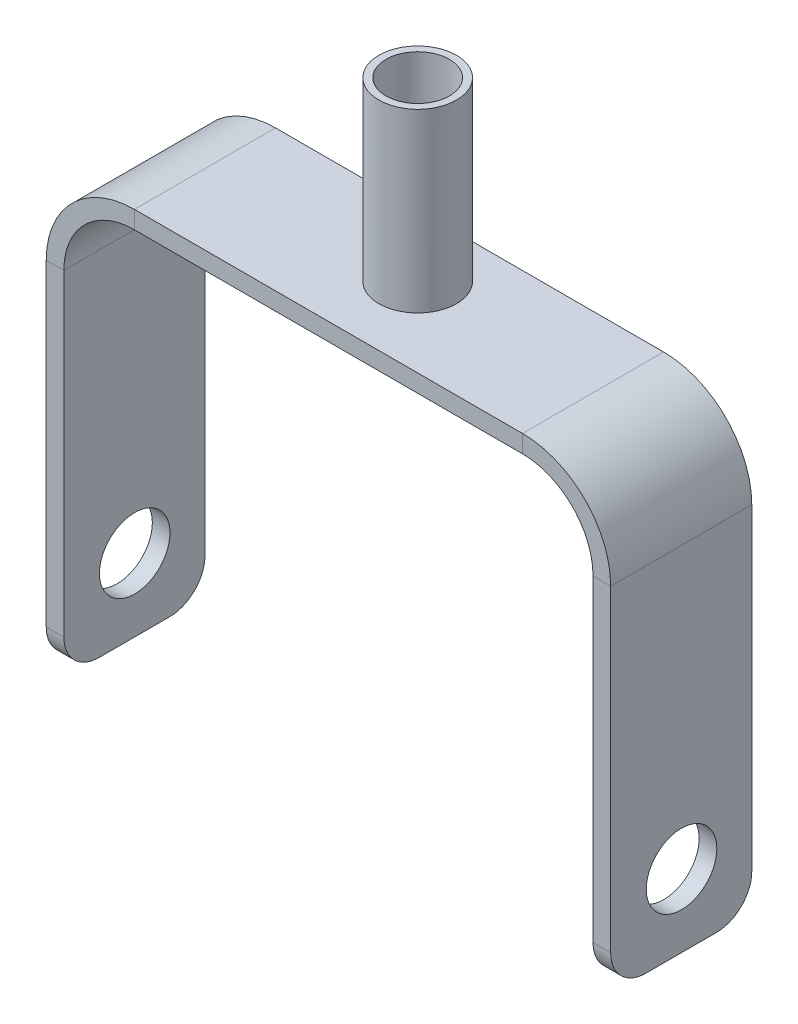
ISO-10303-21;
HEADER;
FILE_DESCRIPTION(('STEP AP214'),'2;1');
FILE_NAME('part.step','',(''),(''),'','','');
FILE_SCHEMA(('AUTOMOTIVE_DESIGN { 1 0 10303 214 1 1 1 1 }'));
ENDSEC;
DATA;
#1=APPLICATION_CONTEXT('core data for automotive mechanical design processes');
#2=APPLICATION_PROTOCOL_DEFINITION('international standard','automotive_design',2000,#1);
#3=PRODUCT_CONTEXT('',#1,'mechanical');
#4=PRODUCT('Part','Part','',(#3));
#5=PRODUCT_RELATED_PRODUCT_CATEGORY('part','',(#4));
#6=PRODUCT_DEFINITION_FORMATION('','',#4);
#7=PRODUCT_DEFINITION_CONTEXT('part definition',#1,'design');
#8=PRODUCT_DEFINITION('design','',#6,#7);
#9=PRODUCT_DEFINITION_SHAPE('','',#8);
#10=(LENGTH_UNIT() NAMED_UNIT(*) SI_UNIT(.MILLI.,.METRE.));
#11=(NAMED_UNIT(*) PLANE_ANGLE_UNIT() SI_UNIT($,.RADIAN.));
#12=(NAMED_UNIT(*) SI_UNIT($,.STERADIAN.) SOLID_ANGLE_UNIT());
#13=UNCERTAINTY_MEASURE_WITH_UNIT(LENGTH_MEASURE(1.E-05),#10,'distance_accuracy_value','');
#14=(GEOMETRIC_REPRESENTATION_CONTEXT(3) GLOBAL_UNCERTAINTY_ASSIGNED_CONTEXT((#13)) GLOBAL_UNIT_ASSIGNED_CONTEXT((#10,
#11,#12)) REPRESENTATION_CONTEXT('',''));
#15=CARTESIAN_POINT('',(0.,0.,0.));
#16=DIRECTION('',(0.,0.,1.));
#17=DIRECTION('',(1.,0.,0.));
#18=AXIS2_PLACEMENT_3D('',#15,#16,#17);
#19=CARTESIAN_POINT('',(20.,125.,40.));
#20=DIRECTION('',(0.,-1.,0.));
#21=DIRECTION('',(0.,0.,-1.));
#22=AXIS2_PLACEMENT_3D('',#19,#20,#21);
#23=PLANE('',#22);
#24=DIRECTION('',(1.,0.,0.));
#25=VECTOR('',#24,1.);
#26=CARTESIAN_POINT('',(20.,125.,0.));
#27=LINE('',#26,#25);
#28=CARTESIAN_POINT('',(130.,125.,0.));
#29=VERTEX_POINT('',#28);
#30=CARTESIAN_POINT('',(20.,125.,0.));
#31=VERTEX_POINT('',#30);
#32=EDGE_CURVE('E228',#29,#31,#27,.F.);
#33=ORIENTED_EDGE('',*,*,#32,.T.);
#34=DIRECTION('',(0.,0.,-1.));
#35=VECTOR('',#34,1.);
#36=CARTESIAN_POINT('',(20.,125.,40.));
#37=LINE('',#36,#35);
#38=CARTESIAN_POINT('',(20.,125.,40.));
#39=VERTEX_POINT('',#38);
#40=EDGE_CURVE('E236',#39,#31,#37,.T.);
#41=ORIENTED_EDGE('',*,*,#40,.F.);
#42=DIRECTION('',(1.,0.,0.));
#43=VECTOR('',#42,1.);
#44=CARTESIAN_POINT('',(20.,125.,40.));
#45=LINE('',#44,#43);
#46=CARTESIAN_POINT('',(130.,125.,40.));
#47=VERTEX_POINT('',#46);
#48=EDGE_CURVE('E203',#47,#39,#45,.F.);
#49=ORIENTED_EDGE('',*,*,#48,.F.);
#50=DIRECTION('',(0.,0.,-1.));
#51=VECTOR('',#50,1.);
#52=CARTESIAN_POINT('',(130.,125.,40.));
#53=LINE('',#52,#51);
#54=EDGE_CURVE('E239',#47,#29,#53,.T.);
#55=ORIENTED_EDGE('',*,*,#54,.T.);
#56=EDGE_LOOP('',(#33,#41,#49,#55));
#57=FACE_BOUND('',#56,.T.);
#58=CARTESIAN_POINT('',(77.8034529187826,125.,17.5080418499708));
#59=DIRECTION('',(0.,-1.,0.));
#60=DIRECTION('',(0.,0.,-1.));
#61=AXIS2_PLACEMENT_3D('',#58,#59,#60);
#62=CIRCLE('',#61,11.);
#63=CARTESIAN_POINT('',(77.8034529187826,125.,6.50804184997082));
#64=VERTEX_POINT('',#63);
#65=EDGE_CURVE('E11',#64,#64,#62,.F.);
#66=ORIENTED_EDGE('',*,*,#65,.F.);
#67=EDGE_LOOP('',(#66));
#68=FACE_BOUND('',#67,.T.);
#69=ADVANCED_FACE('F34',(#57,#68),#23,.F.);
#70=CARTESIAN_POINT('',(0.,100.,40.));
#71=DIRECTION('',(0.,0.,1.));
#72=DIRECTION('',(1.,0.,0.));
#73=AXIS2_PLACEMENT_3D('',#70,#71,#72);
#74=PLANE('',#73);
#75=DIRECTION('',(-1.,0.,0.));
#76=VECTOR('',#75,1.);
#77=CARTESIAN_POINT('',(0.,100.,40.));
#78=LINE('',#77,#76);
#79=CARTESIAN_POINT('',(0.,100.,40.));
#80=VERTEX_POINT('',#79);
#81=CARTESIAN_POINT('',(-5.,100.,40.));
#82=VERTEX_POINT('',#81);
#83=EDGE_CURVE('E149',#80,#82,#78,.T.);
#84=ORIENTED_EDGE('',*,*,#83,.F.);
#85=CARTESIAN_POINT('',(20.,100.,40.));
#86=DIRECTION('',(0.,0.,1.));
#87=DIRECTION('',(-1.,0.,0.));
#88=AXIS2_PLACEMENT_3D('',#85,#86,#87);
#89=CIRCLE('',#88,20.);
#90=CARTESIAN_POINT('',(20.,120.,40.));
#91=VERTEX_POINT('',#90);
#92=EDGE_CURVE('E153',#91,#80,#89,.T.);
#93=ORIENTED_EDGE('',*,*,#92,.F.);
#94=DIRECTION('',(0.,-1.,0.));
#95=VECTOR('',#94,1.);
#96=CARTESIAN_POINT('',(20.,125.,40.));
#97=LINE('',#96,#95);
#98=EDGE_CURVE('E162',#39,#91,#97,.T.);
#99=ORIENTED_EDGE('',*,*,#98,.F.);
#100=CARTESIAN_POINT('',(20.,100.,40.));
#101=DIRECTION('',(0.,0.,1.));
#102=DIRECTION('',(1.,0.,0.));
#103=AXIS2_PLACEMENT_3D('',#100,#101,#102);
#104=CIRCLE('',#103,25.);
#105=EDGE_CURVE('E156',#39,#82,#104,.T.);
#106=ORIENTED_EDGE('',*,*,#105,.T.);
#107=EDGE_LOOP('',(#84,#93,#99,#106));
#108=FACE_BOUND('',#107,.T.);
#109=ADVANCED_FACE('F151',(#108),#74,.T.);
#110=CARTESIAN_POINT('',(20.,125.,40.));
#111=DIRECTION('',(0.,0.,1.));
#112=DIRECTION('',(1.,0.,0.));
#113=AXIS2_PLACEMENT_3D('',#110,#111,#112);
#114=PLANE('',#113);
#115=DIRECTION('',(0.,1.,0.));
#116=VECTOR('',#115,1.);
#117=CARTESIAN_POINT('',(-5.,0.,40.));
#118=LINE('',#117,#116);
#119=CARTESIAN_POINT('',(-5.,10.,40.));
#120=VERTEX_POINT('',#119);
#121=EDGE_CURVE('E183',#82,#120,#118,.F.);
#122=ORIENTED_EDGE('',*,*,#121,.T.);
#123=DIRECTION('',(-1.,0.,0.));
#124=VECTOR('',#123,1.);
#125=CARTESIAN_POINT('',(20.,9.99999999999999,40.));
#126=LINE('',#125,#124);
#127=CARTESIAN_POINT('',(0.,10.,40.));
#128=VERTEX_POINT('',#127);
#129=EDGE_CURVE('E182',#120,#128,#126,.F.);
#130=ORIENTED_EDGE('',*,*,#129,.T.);
#131=DIRECTION('',(0.,-1.,0.));
#132=VECTOR('',#131,1.);
#133=CARTESIAN_POINT('',(0.,0.,40.));
#134=LINE('',#133,#132);
#135=EDGE_CURVE('E170',#80,#128,#134,.T.);
#136=ORIENTED_EDGE('',*,*,#135,.F.);
#137=ORIENTED_EDGE('',*,*,#83,.T.);
#138=EDGE_LOOP('',(#122,#130,#136,#137));
#139=FACE_BOUND('',#138,.T.);
#140=ADVANCED_FACE('F180',(#139),#114,.T.);
#141=CARTESIAN_POINT('',(20.,120.,0.));
#142=DIRECTION('',(0.,0.,-1.));
#143=DIRECTION('',(-1.,0.,0.));
#144=AXIS2_PLACEMENT_3D('',#141,#142,#143);
#145=PLANE('',#144);
#146=DIRECTION('',(0.,1.,0.));
#147=VECTOR('',#146,1.);
#148=CARTESIAN_POINT('',(20.,120.,0.));
#149=LINE('',#148,#147);
#150=CARTESIAN_POINT('',(20.,120.,0.));
#151=VERTEX_POINT('',#150);
#152=EDGE_CURVE('E273',#151,#31,#149,.T.);
#153=ORIENTED_EDGE('',*,*,#152,.F.);
#154=CARTESIAN_POINT('',(20.,100.,0.));
#155=DIRECTION('',(0.,0.,1.));
#156=DIRECTION('',(-1.,0.,0.));
#157=AXIS2_PLACEMENT_3D('',#154,#155,#156);
#158=CIRCLE('',#157,20.);
#159=CARTESIAN_POINT('',(0.,100.,0.));
#160=VERTEX_POINT('',#159);
#161=EDGE_CURVE('E213',#151,#160,#158,.T.);
#162=ORIENTED_EDGE('',*,*,#161,.T.);
#163=DIRECTION('',(1.,0.,0.));
#164=VECTOR('',#163,1.);
#165=CARTESIAN_POINT('',(-5.,100.,0.));
#166=LINE('',#165,#164);
#167=CARTESIAN_POINT('',(-5.,100.,0.));
#168=VERTEX_POINT('',#167);
#169=EDGE_CURVE('E271',#168,#160,#166,.T.);
#170=ORIENTED_EDGE('',*,*,#169,.F.);
#171=CARTESIAN_POINT('',(20.,100.,0.));
#172=DIRECTION('',(0.,0.,1.));
#173=DIRECTION('',(1.,0.,0.));
#174=AXIS2_PLACEMENT_3D('',#171,#172,#173);
#175=CIRCLE('',#174,25.);
#176=EDGE_CURVE('E231',#31,#168,#175,.T.);
#177=ORIENTED_EDGE('',*,*,#176,.F.);
#178=EDGE_LOOP('',(#153,#162,#170,#177));
#179=FACE_BOUND('',#178,.T.);
#180=ADVANCED_FACE('F587',(#179),#145,.T.);
#181=CARTESIAN_POINT('',(-5.,100.,0.));
#182=DIRECTION('',(0.,0.,-1.));
#183=DIRECTION('',(-1.,0.,0.));
#184=AXIS2_PLACEMENT_3D('',#181,#182,#183);
#185=PLANE('',#184);
#186=DIRECTION('',(-1.,0.,0.));
#187=VECTOR('',#186,1.);
#188=CARTESIAN_POINT('',(20.,120.,0.));
#189=LINE('',#188,#187);
#190=CARTESIAN_POINT('',(130.,120.,0.));
#191=VERTEX_POINT('',#190);
#192=EDGE_CURVE('E215',#191,#151,#189,.T.);
#193=ORIENTED_EDGE('',*,*,#192,.T.);
#194=ORIENTED_EDGE('',*,*,#152,.T.);
#195=ORIENTED_EDGE('',*,*,#32,.F.);
#196=DIRECTION('',(0.,-1.,0.));
#197=VECTOR('',#196,1.);
#198=CARTESIAN_POINT('',(130.,125.,0.));
#199=LINE('',#198,#197);
#200=EDGE_CURVE('E261',#29,#191,#199,.T.);
#201=ORIENTED_EDGE('',*,*,#200,.T.);
#202=EDGE_LOOP('',(#193,#194,#195,#201));
#203=FACE_BOUND('',#202,.T.);
#204=ADVANCED_FACE('F654',(#203),#185,.T.);
#205=CARTESIAN_POINT('',(130.,120.,40.));
#206=DIRECTION('',(0.,0.,1.));
#207=DIRECTION('',(1.,0.,0.));
#208=AXIS2_PLACEMENT_3D('',#205,#206,#207);
#209=PLANE('',#208);
#210=DIRECTION('',(0.,1.,0.));
#211=VECTOR('',#210,1.);
#212=CARTESIAN_POINT('',(130.,120.,40.));
#213=LINE('',#212,#211);
#214=CARTESIAN_POINT('',(130.,120.,40.));
#215=VERTEX_POINT('',#214);
#216=EDGE_CURVE('E269',#215,#47,#213,.T.);
#217=ORIENTED_EDGE('',*,*,#216,.F.);
#218=CARTESIAN_POINT('',(130.,100.,40.));
#219=DIRECTION('',(0.,0.,1.));
#220=DIRECTION('',(-1.,0.,0.));
#221=AXIS2_PLACEMENT_3D('',#218,#219,#220);
#222=CIRCLE('',#221,20.);
#223=CARTESIAN_POINT('',(150.,100.,40.));
#224=VERTEX_POINT('',#223);
#225=EDGE_CURVE('E190',#224,#215,#222,.T.);
#226=ORIENTED_EDGE('',*,*,#225,.F.);
#227=DIRECTION('',(-1.,0.,0.));
#228=VECTOR('',#227,1.);
#229=CARTESIAN_POINT('',(155.,100.,40.));
#230=LINE('',#229,#228);
#231=CARTESIAN_POINT('',(155.,100.,40.));
#232=VERTEX_POINT('',#231);
#233=EDGE_CURVE('E266',#232,#224,#230,.T.);
#234=ORIENTED_EDGE('',*,*,#233,.F.);
#235=CARTESIAN_POINT('',(130.,100.,40.));
#236=DIRECTION('',(0.,0.,1.));
#237=DIRECTION('',(1.,0.,0.));
#238=AXIS2_PLACEMENT_3D('',#235,#236,#237);
#239=CIRCLE('',#238,25.);
#240=EDGE_CURVE('E200',#232,#47,#239,.T.);
#241=ORIENTED_EDGE('',*,*,#240,.T.);
#242=EDGE_LOOP('',(#217,#226,#234,#241));
#243=FACE_BOUND('',#242,.T.);
#244=ADVANCED_FACE('F333',(#243),#209,.T.);
#245=CARTESIAN_POINT('',(155.,100.,40.));
#246=DIRECTION('',(0.,0.,1.));
#247=DIRECTION('',(1.,0.,0.));
#248=AXIS2_PLACEMENT_3D('',#245,#246,#247);
#249=PLANE('',#248);
#250=DIRECTION('',(-1.,0.,0.));
#251=VECTOR('',#250,1.);
#252=CARTESIAN_POINT('',(20.,120.,40.));
#253=LINE('',#252,#251);
#254=EDGE_CURVE('E188',#215,#91,#253,.T.);
#255=ORIENTED_EDGE('',*,*,#254,.F.);
#256=ORIENTED_EDGE('',*,*,#216,.T.);
#257=ORIENTED_EDGE('',*,*,#48,.T.);
#258=ORIENTED_EDGE('',*,*,#98,.T.);
#259=EDGE_LOOP('',(#255,#256,#257,#258));
#260=FACE_BOUND('',#259,.T.);
#261=ADVANCED_FACE('F342',(#260),#249,.T.);
#262=CARTESIAN_POINT('',(150.,100.,0.));
#263=DIRECTION('',(0.,0.,-1.));
#264=DIRECTION('',(-1.,0.,0.));
#265=AXIS2_PLACEMENT_3D('',#262,#263,#264);
#266=PLANE('',#265);
#267=DIRECTION('',(1.,0.,0.));
#268=VECTOR('',#267,1.);
#269=CARTESIAN_POINT('',(150.,100.,0.));
#270=LINE('',#269,#268);
#271=CARTESIAN_POINT('',(150.,100.,0.));
#272=VERTEX_POINT('',#271);
#273=CARTESIAN_POINT('',(155.,100.,0.));
#274=VERTEX_POINT('',#273);
#275=EDGE_CURVE('E263',#272,#274,#270,.T.);
#276=ORIENTED_EDGE('',*,*,#275,.F.);
#277=CARTESIAN_POINT('',(130.,100.,0.));
#278=DIRECTION('',(0.,0.,1.));
#279=DIRECTION('',(-1.,0.,0.));
#280=AXIS2_PLACEMENT_3D('',#277,#278,#279);
#281=CIRCLE('',#280,20.);
#282=EDGE_CURVE('E218',#272,#191,#281,.T.);
#283=ORIENTED_EDGE('',*,*,#282,.T.);
#284=ORIENTED_EDGE('',*,*,#200,.F.);
#285=CARTESIAN_POINT('',(130.,100.,0.));
#286=DIRECTION('',(0.,0.,1.));
#287=DIRECTION('',(1.,0.,0.));
#288=AXIS2_PLACEMENT_3D('',#285,#286,#287);
#289=CIRCLE('',#288,25.);
#290=EDGE_CURVE('E225',#274,#29,#289,.T.);
#291=ORIENTED_EDGE('',*,*,#290,.F.);
#292=EDGE_LOOP('',(#276,#283,#284,#291));
#293=FACE_BOUND('',#292,.T.);
#294=ADVANCED_FACE('F575',(#293),#266,.T.);
#295=CARTESIAN_POINT('',(130.,125.,0.));
#296=DIRECTION('',(0.,0.,-1.));
#297=DIRECTION('',(-1.,0.,0.));
#298=AXIS2_PLACEMENT_3D('',#295,#296,#297);
#299=PLANE('',#298);
#300=DIRECTION('',(0.,1.,0.));
#301=VECTOR('',#300,1.);
#302=CARTESIAN_POINT('',(155.,0.,0.));
#303=LINE('',#302,#301);
#304=CARTESIAN_POINT('',(155.,10.,0.));
#305=VERTEX_POINT('',#304);
#306=EDGE_CURVE('E223',#305,#274,#303,.T.);
#307=ORIENTED_EDGE('',*,*,#306,.F.);
#308=DIRECTION('',(-1.,0.,0.));
#309=VECTOR('',#308,1.);
#310=CARTESIAN_POINT('',(130.,10.,0.));
#311=LINE('',#310,#309);
#312=CARTESIAN_POINT('',(150.,10.,0.));
#313=VERTEX_POINT('',#312);
#314=EDGE_CURVE('E292',#305,#313,#311,.T.);
#315=ORIENTED_EDGE('',*,*,#314,.T.);
#316=DIRECTION('',(0.,1.,0.));
#317=VECTOR('',#316,1.);
#318=CARTESIAN_POINT('',(150.,0.,0.));
#319=LINE('',#318,#317);
#320=EDGE_CURVE('E221',#313,#272,#319,.T.);
#321=ORIENTED_EDGE('',*,*,#320,.T.);
#322=ORIENTED_EDGE('',*,*,#275,.T.);
#323=EDGE_LOOP('',(#307,#315,#321,#322));
#324=FACE_BOUND('',#323,.T.);
#325=ADVANCED_FACE('F314',(#324),#299,.T.);
#326=CARTESIAN_POINT('',(-5.,0.,40.));
#327=DIRECTION('',(1.,0.,0.));
#328=DIRECTION('',(0.,0.,-1.));
#329=AXIS2_PLACEMENT_3D('',#326,#327,#328);
#330=PLANE('',#329);
#331=CARTESIAN_POINT('',(-5.,20.5452430477246,19.9181181030666));
#332=DIRECTION('',(1.,0.,0.));
#333=DIRECTION('',(0.,0.,-1.));
#334=AXIS2_PLACEMENT_3D('',#331,#332,#333);
#335=CIRCLE('',#334,10.);
#336=CARTESIAN_POINT('',(-5.,20.5452430477246,9.91811810306659));
#337=VERTEX_POINT('',#336);
#338=EDGE_CURVE('E362',#337,#337,#335,.T.);
#339=ORIENTED_EDGE('',*,*,#338,.T.);
#340=EDGE_LOOP('',(#339));
#341=FACE_BOUND('',#340,.T.);
#342=DIRECTION('',(0.,0.,-1.));
#343=VECTOR('',#342,1.);
#344=CARTESIAN_POINT('',(-5.,0.,40.));
#345=LINE('',#344,#343);
#346=CARTESIAN_POINT('',(-5.,0.,30.));
#347=VERTEX_POINT('',#346);
#348=CARTESIAN_POINT('',(-5.,0.,10.));
#349=VERTEX_POINT('',#348);
#350=EDGE_CURVE('E258',#347,#349,#345,.T.);
#351=ORIENTED_EDGE('',*,*,#350,.F.);
#352=CARTESIAN_POINT('',(-5.,10.,30.));
#353=DIRECTION('',(1.,0.,0.));
#354=DIRECTION('',(0.,0.,-1.));
#355=AXIS2_PLACEMENT_3D('',#352,#353,#354);
#356=CIRCLE('',#355,10.);
#357=EDGE_CURVE('E282',#347,#120,#356,.F.);
#358=ORIENTED_EDGE('',*,*,#357,.T.);
#359=ORIENTED_EDGE('',*,*,#121,.F.);
#360=DIRECTION('',(0.,0.,-1.));
#361=VECTOR('',#360,1.);
#362=CARTESIAN_POINT('',(-5.,100.,40.));
#363=LINE('',#362,#361);
#364=EDGE_CURVE('E207',#82,#168,#363,.T.);
#365=ORIENTED_EDGE('',*,*,#364,.T.);
#366=DIRECTION('',(0.,1.,0.));
#367=VECTOR('',#366,1.);
#368=CARTESIAN_POINT('',(-5.,0.,0.));
#369=LINE('',#368,#367);
#370=CARTESIAN_POINT('',(-5.,9.99999999999999,0.));
#371=VERTEX_POINT('',#370);
#372=EDGE_CURVE('E208',#168,#371,#369,.F.);
#373=ORIENTED_EDGE('',*,*,#372,.T.);
#374=CARTESIAN_POINT('',(-5.,9.99999999999999,10.));
#375=DIRECTION('',(1.,0.,0.));
#376=DIRECTION('',(0.,0.,-1.));
#377=AXIS2_PLACEMENT_3D('',#374,#375,#376);
#378=CIRCLE('',#377,10.);
#379=EDGE_CURVE('E280',#371,#349,#378,.F.);
#380=ORIENTED_EDGE('',*,*,#379,.T.);
#381=EDGE_LOOP('',(#351,#358,#359,#365,#373,#380));
#382=FACE_BOUND('',#381,.T.);
#383=ADVANCED_FACE('F355',(#341,#382),#330,.F.);
#384=CARTESIAN_POINT('',(0.,0.,40.));
#385=DIRECTION('',(0.,-1.,0.));
#386=DIRECTION('',(0.,0.,-1.));
#387=AXIS2_PLACEMENT_3D('',#384,#385,#386);
#388=PLANE('',#387);
#389=DIRECTION('',(0.,0.,-1.));
#390=VECTOR('',#389,1.);
#391=CARTESIAN_POINT('',(0.,0.,40.));
#392=LINE('',#391,#390);
#393=CARTESIAN_POINT('',(0.,0.,30.));
#394=VERTEX_POINT('',#393);
#395=CARTESIAN_POINT('',(0.,0.,10.));
#396=VERTEX_POINT('',#395);
#397=EDGE_CURVE('E177',#394,#396,#392,.T.);
#398=ORIENTED_EDGE('',*,*,#397,.F.);
#399=DIRECTION('',(-1.,0.,0.));
#400=VECTOR('',#399,1.);
#401=CARTESIAN_POINT('',(0.,0.,30.));
#402=LINE('',#401,#400);
#403=EDGE_CURVE('E277',#394,#347,#402,.T.);
#404=ORIENTED_EDGE('',*,*,#403,.T.);
#405=ORIENTED_EDGE('',*,*,#350,.T.);
#406=DIRECTION('',(-1.,0.,0.));
#407=VECTOR('',#406,1.);
#408=CARTESIAN_POINT('',(0.,0.,10.));
#409=LINE('',#408,#407);
#410=EDGE_CURVE('E161',#349,#396,#409,.F.);
#411=ORIENTED_EDGE('',*,*,#410,.T.);
#412=EDGE_LOOP('',(#398,#404,#405,#411));
#413=FACE_BOUND('',#412,.T.);
#414=ADVANCED_FACE('F481',(#413),#388,.T.);
#415=CARTESIAN_POINT('',(0.,0.,40.));
#416=DIRECTION('',(1.,0.,0.));
#417=DIRECTION('',(0.,0.,-1.));
#418=AXIS2_PLACEMENT_3D('',#415,#416,#417);
#419=PLANE('',#418);
#420=CARTESIAN_POINT('',(0.,20.5452430477246,19.9181181030666));
#421=DIRECTION('',(1.,0.,0.));
#422=DIRECTION('',(0.,0.,-1.));
#423=AXIS2_PLACEMENT_3D('',#420,#421,#422);
#424=CIRCLE('',#423,10.);
#425=CARTESIAN_POINT('',(0.,20.5452430477246,9.91811810306659));
#426=VERTEX_POINT('',#425);
#427=EDGE_CURVE('E211',#426,#426,#424,.T.);
#428=ORIENTED_EDGE('',*,*,#427,.F.);
#429=EDGE_LOOP('',(#428));
#430=FACE_BOUND('',#429,.T.);
#431=ORIENTED_EDGE('',*,*,#135,.T.);
#432=CARTESIAN_POINT('',(0.,10.,30.));
#433=DIRECTION('',(1.,0.,0.));
#434=DIRECTION('',(0.,0.,-1.));
#435=AXIS2_PLACEMENT_3D('',#432,#433,#434);
#436=CIRCLE('',#435,10.);
#437=EDGE_CURVE('E287',#128,#394,#436,.T.);
#438=ORIENTED_EDGE('',*,*,#437,.T.);
#439=ORIENTED_EDGE('',*,*,#397,.T.);
#440=CARTESIAN_POINT('',(0.,9.99999999999999,10.));
#441=DIRECTION('',(1.,0.,0.));
#442=DIRECTION('',(0.,0.,-1.));
#443=AXIS2_PLACEMENT_3D('',#440,#441,#442);
#444=CIRCLE('',#443,10.);
#445=CARTESIAN_POINT('',(0.,9.99999999999999,0.));
#446=VERTEX_POINT('',#445);
#447=EDGE_CURVE('E285',#396,#446,#444,.T.);
#448=ORIENTED_EDGE('',*,*,#447,.T.);
#449=DIRECTION('',(0.,-1.,0.));
#450=VECTOR('',#449,1.);
#451=CARTESIAN_POINT('',(0.,0.,0.));
#452=LINE('',#451,#450);
#453=EDGE_CURVE('E173',#160,#446,#452,.T.);
#454=ORIENTED_EDGE('',*,*,#453,.F.);
#455=DIRECTION('',(0.,0.,-1.));
#456=VECTOR('',#455,1.);
#457=CARTESIAN_POINT('',(0.,100.,40.));
#458=LINE('',#457,#456);
#459=EDGE_CURVE('E168',#80,#160,#458,.T.);
#460=ORIENTED_EDGE('',*,*,#459,.F.);
#461=EDGE_LOOP('',(#431,#438,#439,#448,#454,#460));
#462=FACE_BOUND('',#461,.T.);
#463=ADVANCED_FACE('F169',(#430,#462),#419,.T.);
#464=CARTESIAN_POINT('',(20.,100.,40.));
#465=DIRECTION('',(0.,0.,-1.));
#466=DIRECTION('',(-1.,0.,0.));
#467=AXIS2_PLACEMENT_3D('',#464,#465,#466);
#468=CYLINDRICAL_SURFACE('',#467,20.);
#469=ORIENTED_EDGE('',*,*,#161,.F.);
#470=DIRECTION('',(0.,0.,-1.));
#471=VECTOR('',#470,1.);
#472=CARTESIAN_POINT('',(20.,120.,40.));
#473=LINE('',#472,#471);
#474=EDGE_CURVE('E178',#91,#151,#473,.T.);
#475=ORIENTED_EDGE('',*,*,#474,.F.);
#476=ORIENTED_EDGE('',*,*,#92,.T.);
#477=ORIENTED_EDGE('',*,*,#459,.T.);
#478=EDGE_LOOP('',(#469,#475,#476,#477));
#479=FACE_BOUND('',#478,.T.);
#480=ADVANCED_FACE('F186',(#479),#468,.F.);
#481=CARTESIAN_POINT('',(20.,120.,40.));
#482=DIRECTION('',(0.,-1.,0.));
#483=DIRECTION('',(0.,0.,-1.));
#484=AXIS2_PLACEMENT_3D('',#481,#482,#483);
#485=PLANE('',#484);
#486=ORIENTED_EDGE('',*,*,#192,.F.);
#487=DIRECTION('',(0.,0.,-1.));
#488=VECTOR('',#487,1.);
#489=CARTESIAN_POINT('',(130.,120.,40.));
#490=LINE('',#489,#488);
#491=EDGE_CURVE('E252',#215,#191,#490,.T.);
#492=ORIENTED_EDGE('',*,*,#491,.F.);
#493=ORIENTED_EDGE('',*,*,#254,.T.);
#494=ORIENTED_EDGE('',*,*,#474,.T.);
#495=EDGE_LOOP('',(#486,#492,#493,#494));
#496=FACE_BOUND('',#495,.T.);
#497=ADVANCED_FACE('F341',(#496),#485,.T.);
#498=CARTESIAN_POINT('',(130.,100.,40.));
#499=DIRECTION('',(0.,0.,-1.));
#500=DIRECTION('',(-1.,0.,0.));
#501=AXIS2_PLACEMENT_3D('',#498,#499,#500);
#502=CYLINDRICAL_SURFACE('',#501,20.);
#503=ORIENTED_EDGE('',*,*,#282,.F.);
#504=DIRECTION('',(0.,0.,-1.));
#505=VECTOR('',#504,1.);
#506=CARTESIAN_POINT('',(150.,100.,40.));
#507=LINE('',#506,#505);
#508=EDGE_CURVE('E249',#224,#272,#507,.T.);
#509=ORIENTED_EDGE('',*,*,#508,.F.);
#510=ORIENTED_EDGE('',*,*,#225,.T.);
#511=ORIENTED_EDGE('',*,*,#491,.T.);
#512=EDGE_LOOP('',(#503,#509,#510,#511));
#513=FACE_BOUND('',#512,.T.);
#514=ADVANCED_FACE('F332',(#513),#502,.F.);
#515=CARTESIAN_POINT('',(150.,0.,40.));
#516=DIRECTION('',(-1.,0.,0.));
#517=DIRECTION('',(0.,0.,1.));
#518=AXIS2_PLACEMENT_3D('',#515,#516,#517);
#519=PLANE('',#518);
#520=CARTESIAN_POINT('',(150.,20.5452430477246,19.9181181030666));
#521=DIRECTION('',(-1.,0.,0.));
#522=DIRECTION('',(0.,0.,1.));
#523=AXIS2_PLACEMENT_3D('',#520,#521,#522);
#524=CIRCLE('',#523,10.);
#525=CARTESIAN_POINT('',(150.,20.5452430477246,29.9181181030666));
#526=VERTEX_POINT('',#525);
#527=EDGE_CURVE('E359',#526,#526,#524,.T.);
#528=ORIENTED_EDGE('',*,*,#527,.F.);
#529=EDGE_LOOP('',(#528));
#530=FACE_BOUND('',#529,.T.);
#531=ORIENTED_EDGE('',*,*,#320,.F.);
#532=CARTESIAN_POINT('',(150.,10.,10.));
#533=DIRECTION('',(-1.,0.,0.));
#534=DIRECTION('',(0.,0.,1.));
#535=AXIS2_PLACEMENT_3D('',#532,#533,#534);
#536=CIRCLE('',#535,10.);
#537=CARTESIAN_POINT('',(150.,0.,10.));
#538=VERTEX_POINT('',#537);
#539=EDGE_CURVE('E297',#313,#538,#536,.T.);
#540=ORIENTED_EDGE('',*,*,#539,.T.);
#541=DIRECTION('',(0.,0.,-1.));
#542=VECTOR('',#541,1.);
#543=CARTESIAN_POINT('',(150.,0.,40.));
#544=LINE('',#543,#542);
#545=CARTESIAN_POINT('',(150.,0.,30.));
#546=VERTEX_POINT('',#545);
#547=EDGE_CURVE('E247',#546,#538,#544,.T.);
#548=ORIENTED_EDGE('',*,*,#547,.F.);
#549=CARTESIAN_POINT('',(150.,10.,30.));
#550=DIRECTION('',(-1.,0.,0.));
#551=DIRECTION('',(0.,0.,1.));
#552=AXIS2_PLACEMENT_3D('',#549,#550,#551);
#553=CIRCLE('',#552,10.);
#554=CARTESIAN_POINT('',(150.,10.,40.));
#555=VERTEX_POINT('',#554);
#556=EDGE_CURVE('E295',#546,#555,#553,.T.);
#557=ORIENTED_EDGE('',*,*,#556,.T.);
#558=DIRECTION('',(0.,1.,0.));
#559=VECTOR('',#558,1.);
#560=CARTESIAN_POINT('',(150.,0.,40.));
#561=LINE('',#560,#559);
#562=EDGE_CURVE('E196',#555,#224,#561,.T.);
#563=ORIENTED_EDGE('',*,*,#562,.T.);
#564=ORIENTED_EDGE('',*,*,#508,.T.);
#565=EDGE_LOOP('',(#531,#540,#548,#557,#563,#564));
#566=FACE_BOUND('',#565,.T.);
#567=ADVANCED_FACE('F320',(#530,#566),#519,.T.);
#568=CARTESIAN_POINT('',(155.,0.,40.));
#569=DIRECTION('',(0.,-1.,0.));
#570=DIRECTION('',(0.,0.,-1.));
#571=AXIS2_PLACEMENT_3D('',#568,#569,#570);
#572=PLANE('',#571);
#573=ORIENTED_EDGE('',*,*,#547,.T.);
#574=DIRECTION('',(-1.,0.,0.));
#575=VECTOR('',#574,1.);
#576=CARTESIAN_POINT('',(155.,0.,10.));
#577=LINE('',#576,#575);
#578=CARTESIAN_POINT('',(155.,0.,10.));
#579=VERTEX_POINT('',#578);
#580=EDGE_CURVE('E56',#538,#579,#577,.F.);
#581=ORIENTED_EDGE('',*,*,#580,.T.);
#582=DIRECTION('',(0.,0.,-1.));
#583=VECTOR('',#582,1.);
#584=CARTESIAN_POINT('',(155.,0.,40.));
#585=LINE('',#584,#583);
#586=CARTESIAN_POINT('',(155.,0.,30.));
#587=VERTEX_POINT('',#586);
#588=EDGE_CURVE('E245',#587,#579,#585,.T.);
#589=ORIENTED_EDGE('',*,*,#588,.F.);
#590=DIRECTION('',(-1.,0.,0.));
#591=VECTOR('',#590,1.);
#592=CARTESIAN_POINT('',(155.,0.,30.));
#593=LINE('',#592,#591);
#594=EDGE_CURVE('E299',#587,#546,#593,.T.);
#595=ORIENTED_EDGE('',*,*,#594,.T.);
#596=EDGE_LOOP('',(#573,#581,#589,#595));
#597=FACE_BOUND('',#596,.T.);
#598=ADVANCED_FACE('F321',(#597),#572,.T.);
#599=CARTESIAN_POINT('',(155.,0.,40.));
#600=DIRECTION('',(-1.,0.,0.));
#601=DIRECTION('',(0.,0.,1.));
#602=AXIS2_PLACEMENT_3D('',#599,#600,#601);
#603=PLANE('',#602);
#604=CARTESIAN_POINT('',(155.,20.5452430477246,19.9181181030666));
#605=DIRECTION('',(1.,0.,0.));
#606=DIRECTION('',(0.,0.,-1.));
#607=AXIS2_PLACEMENT_3D('',#604,#605,#606);
#608=CIRCLE('',#607,10.);
#609=CARTESIAN_POINT('',(155.,20.5452430477246,9.91811810306659));
#610=VERTEX_POINT('',#609);
#611=EDGE_CURVE('E363',#610,#610,#608,.T.);
#612=ORIENTED_EDGE('',*,*,#611,.F.);
#613=EDGE_LOOP('',(#612));
#614=FACE_BOUND('',#613,.T.);
#615=ORIENTED_EDGE('',*,*,#588,.T.);
#616=CARTESIAN_POINT('',(155.,10.,10.));
#617=DIRECTION('',(-1.,0.,0.));
#618=DIRECTION('',(0.,0.,1.));
#619=AXIS2_PLACEMENT_3D('',#616,#617,#618);
#620=CIRCLE('',#619,10.);
#621=EDGE_CURVE('E305',#579,#305,#620,.F.);
#622=ORIENTED_EDGE('',*,*,#621,.T.);
#623=ORIENTED_EDGE('',*,*,#306,.T.);
#624=DIRECTION('',(0.,0.,-1.));
#625=VECTOR('',#624,1.);
#626=CARTESIAN_POINT('',(155.,100.,40.));
#627=LINE('',#626,#625);
#628=EDGE_CURVE('E242',#232,#274,#627,.T.);
#629=ORIENTED_EDGE('',*,*,#628,.F.);
#630=DIRECTION('',(0.,1.,0.));
#631=VECTOR('',#630,1.);
#632=CARTESIAN_POINT('',(155.,0.,40.));
#633=LINE('',#632,#631);
#634=CARTESIAN_POINT('',(155.,10.,40.));
#635=VERTEX_POINT('',#634);
#636=EDGE_CURVE('E198',#635,#232,#633,.T.);
#637=ORIENTED_EDGE('',*,*,#636,.F.);
#638=CARTESIAN_POINT('',(155.,10.,30.));
#639=DIRECTION('',(-1.,0.,0.));
#640=DIRECTION('',(0.,0.,1.));
#641=AXIS2_PLACEMENT_3D('',#638,#639,#640);
#642=CIRCLE('',#641,10.);
#643=EDGE_CURVE('E303',#635,#587,#642,.F.);
#644=ORIENTED_EDGE('',*,*,#643,.T.);
#645=EDGE_LOOP('',(#615,#622,#623,#629,#637,#644));
#646=FACE_BOUND('',#645,.T.);
#647=ADVANCED_FACE('F309',(#614,#646),#603,.F.);
#648=CARTESIAN_POINT('',(130.,100.,40.));
#649=DIRECTION('',(0.,0.,-1.));
#650=DIRECTION('',(-1.,0.,0.));
#651=AXIS2_PLACEMENT_3D('',#648,#649,#650);
#652=CYLINDRICAL_SURFACE('',#651,25.);
#653=ORIENTED_EDGE('',*,*,#290,.T.);
#654=ORIENTED_EDGE('',*,*,#54,.F.);
#655=ORIENTED_EDGE('',*,*,#240,.F.);
#656=ORIENTED_EDGE('',*,*,#628,.T.);
#657=EDGE_LOOP('',(#653,#654,#655,#656));
#658=FACE_BOUND('',#657,.T.);
#659=ADVANCED_FACE('F454',(#658),#652,.T.);
#660=CARTESIAN_POINT('',(20.,100.,40.));
#661=DIRECTION('',(0.,0.,-1.));
#662=DIRECTION('',(-1.,0.,0.));
#663=AXIS2_PLACEMENT_3D('',#660,#661,#662);
#664=CYLINDRICAL_SURFACE('',#663,25.);
#665=ORIENTED_EDGE('',*,*,#176,.T.);
#666=ORIENTED_EDGE('',*,*,#364,.F.);
#667=ORIENTED_EDGE('',*,*,#105,.F.);
#668=ORIENTED_EDGE('',*,*,#40,.T.);
#669=EDGE_LOOP('',(#665,#666,#667,#668));
#670=FACE_BOUND('',#669,.T.);
#671=ADVANCED_FACE('F350',(#670),#664,.T.);
#672=CARTESIAN_POINT('',(20.,100.,40.));
#673=DIRECTION('',(0.,0.,1.));
#674=DIRECTION('',(1.,0.,0.));
#675=AXIS2_PLACEMENT_3D('',#672,#673,#674);
#676=PLANE('',#675);
#677=ORIENTED_EDGE('',*,*,#562,.F.);
#678=DIRECTION('',(-1.,0.,0.));
#679=VECTOR('',#678,1.);
#680=CARTESIAN_POINT('',(20.,10.,40.));
#681=LINE('',#680,#679);
#682=EDGE_CURVE('E42',#555,#635,#681,.F.);
#683=ORIENTED_EDGE('',*,*,#682,.T.);
#684=ORIENTED_EDGE('',*,*,#636,.T.);
#685=ORIENTED_EDGE('',*,*,#233,.T.);
#686=EDGE_LOOP('',(#677,#683,#684,#685));
#687=FACE_BOUND('',#686,.T.);
#688=ADVANCED_FACE('F325',(#687),#676,.T.);
#689=CARTESIAN_POINT('',(20.,100.,0.));
#690=DIRECTION('',(0.,0.,1.));
#691=DIRECTION('',(1.,0.,0.));
#692=AXIS2_PLACEMENT_3D('',#689,#690,#691);
#693=PLANE('',#692);
#694=ORIENTED_EDGE('',*,*,#453,.T.);
#695=DIRECTION('',(-1.,0.,0.));
#696=VECTOR('',#695,1.);
#697=CARTESIAN_POINT('',(-5.,9.99999999999999,0.));
#698=LINE('',#697,#696);
#699=EDGE_CURVE('E289',#446,#371,#698,.T.);
#700=ORIENTED_EDGE('',*,*,#699,.T.);
#701=ORIENTED_EDGE('',*,*,#372,.F.);
#702=ORIENTED_EDGE('',*,*,#169,.T.);
#703=EDGE_LOOP('',(#694,#700,#701,#702));
#704=FACE_BOUND('',#703,.T.);
#705=ADVANCED_FACE('F531',(#704),#693,.F.);
#706=CARTESIAN_POINT('',(0.,10.,30.));
#707=DIRECTION('',(-1.,0.,0.));
#708=DIRECTION('',(0.,0.,1.));
#709=AXIS2_PLACEMENT_3D('',#706,#707,#708);
#710=CYLINDRICAL_SURFACE('',#709,10.);
#711=ORIENTED_EDGE('',*,*,#437,.F.);
#712=ORIENTED_EDGE('',*,*,#129,.F.);
#713=ORIENTED_EDGE('',*,*,#357,.F.);
#714=ORIENTED_EDGE('',*,*,#403,.F.);
#715=EDGE_LOOP('',(#711,#712,#713,#714));
#716=FACE_BOUND('',#715,.T.);
#717=ADVANCED_FACE('F521',(#716),#710,.T.);
#718=CARTESIAN_POINT('',(20.,9.99999999999999,10.));
#719=DIRECTION('',(1.,0.,0.));
#720=DIRECTION('',(0.,0.,-1.));
#721=AXIS2_PLACEMENT_3D('',#718,#719,#720);
#722=CYLINDRICAL_SURFACE('',#721,10.);
#723=ORIENTED_EDGE('',*,*,#447,.F.);
#724=ORIENTED_EDGE('',*,*,#410,.F.);
#725=ORIENTED_EDGE('',*,*,#379,.F.);
#726=ORIENTED_EDGE('',*,*,#699,.F.);
#727=EDGE_LOOP('',(#723,#724,#725,#726));
#728=FACE_BOUND('',#727,.T.);
#729=ADVANCED_FACE('F513',(#728),#722,.T.);
#730=CARTESIAN_POINT('',(130.,10.,10.));
#731=DIRECTION('',(-1.,0.,0.));
#732=DIRECTION('',(0.,0.,1.));
#733=AXIS2_PLACEMENT_3D('',#730,#731,#732);
#734=CYLINDRICAL_SURFACE('',#733,10.);
#735=ORIENTED_EDGE('',*,*,#621,.F.);
#736=ORIENTED_EDGE('',*,*,#580,.F.);
#737=ORIENTED_EDGE('',*,*,#539,.F.);
#738=ORIENTED_EDGE('',*,*,#314,.F.);
#739=EDGE_LOOP('',(#735,#736,#737,#738));
#740=FACE_BOUND('',#739,.T.);
#741=ADVANCED_FACE('F317',(#740),#734,.T.);
#742=CARTESIAN_POINT('',(155.,10.,30.));
#743=DIRECTION('',(-1.,0.,0.));
#744=DIRECTION('',(0.,0.,1.));
#745=AXIS2_PLACEMENT_3D('',#742,#743,#744);
#746=CYLINDRICAL_SURFACE('',#745,10.);
#747=ORIENTED_EDGE('',*,*,#643,.F.);
#748=ORIENTED_EDGE('',*,*,#682,.F.);
#749=ORIENTED_EDGE('',*,*,#556,.F.);
#750=ORIENTED_EDGE('',*,*,#594,.F.);
#751=EDGE_LOOP('',(#747,#748,#749,#750));
#752=FACE_BOUND('',#751,.T.);
#753=ADVANCED_FACE('F36',(#752),#746,.T.);
#754=CARTESIAN_POINT('',(-5.,20.5452430477246,19.9181181030666));
#755=DIRECTION('',(1.,0.,0.));
#756=DIRECTION('',(0.,0.,-1.));
#757=AXIS2_PLACEMENT_3D('',#754,#755,#756);
#758=CYLINDRICAL_SURFACE('',#757,10.);
#759=ORIENTED_EDGE('',*,*,#527,.T.);
#760=EDGE_LOOP('',(#759));
#761=FACE_BOUND('',#760,.T.);
#762=ORIENTED_EDGE('',*,*,#611,.T.);
#763=EDGE_LOOP('',(#762));
#764=FACE_BOUND('',#763,.T.);
#765=ADVANCED_FACE('F393',(#761,#764),#758,.F.);
#766=ORIENTED_EDGE('',*,*,#427,.T.);
#767=EDGE_LOOP('',(#766));
#768=FACE_BOUND('',#767,.T.);
#769=ORIENTED_EDGE('',*,*,#338,.F.);
#770=EDGE_LOOP('',(#769));
#771=FACE_BOUND('',#770,.T.);
#772=ADVANCED_FACE('F384',(#768,#771),#758,.F.);
#773=CARTESIAN_POINT('',(77.8034529187826,175.,17.5080418499708));
#774=DIRECTION('',(0.,1.,0.));
#775=DIRECTION('',(0.,0.,1.));
#776=AXIS2_PLACEMENT_3D('',#773,#774,#775);
#777=PLANE('',#776);
#778=CARTESIAN_POINT('',(77.8034529187826,175.,17.5080418499708));
#779=DIRECTION('',(0.,1.,0.));
#780=DIRECTION('',(0.,0.,1.));
#781=AXIS2_PLACEMENT_3D('',#778,#779,#780);
#782=CIRCLE('',#781,11.);
#783=CARTESIAN_POINT('',(77.8034529187826,175.,28.5080418499708));
#784=VERTEX_POINT('',#783);
#785=EDGE_CURVE('E366',#784,#784,#782,.T.);
#786=ORIENTED_EDGE('',*,*,#785,.T.);
#787=EDGE_LOOP('',(#786));
#788=FACE_BOUND('',#787,.T.);
#789=CARTESIAN_POINT('',(77.8034529187826,175.,17.5080418499708));
#790=DIRECTION('',(0.,1.,0.));
#791=DIRECTION('',(0.,0.,1.));
#792=AXIS2_PLACEMENT_3D('',#789,#790,#791);
#793=CIRCLE('',#792,9.);
#794=CARTESIAN_POINT('',(77.8034529187826,175.,26.5080418499708));
#795=VERTEX_POINT('',#794);
#796=EDGE_CURVE('E371',#795,#795,#793,.T.);
#797=ORIENTED_EDGE('',*,*,#796,.F.);
#798=EDGE_LOOP('',(#797));
#799=FACE_BOUND('',#798,.T.);
#800=ADVANCED_FACE('F381',(#788,#799),#777,.T.);
#801=CARTESIAN_POINT('',(77.8034529187826,175.,17.5080418499708));
#802=DIRECTION('',(0.,-1.,0.));
#803=DIRECTION('',(0.,0.,-1.));
#804=AXIS2_PLACEMENT_3D('',#801,#802,#803);
#805=CYLINDRICAL_SURFACE('',#804,11.);
#806=ORIENTED_EDGE('',*,*,#785,.F.);
#807=EDGE_LOOP('',(#806));
#808=FACE_BOUND('',#807,.T.);
#809=ORIENTED_EDGE('',*,*,#65,.T.);
#810=EDGE_LOOP('',(#809));
#811=FACE_BOUND('',#810,.T.);
#812=ADVANCED_FACE('F383',(#808,#811),#805,.T.);
#813=CARTESIAN_POINT('',(77.8034529187826,175.,17.5080418499708));
#814=DIRECTION('',(0.,-1.,0.));
#815=DIRECTION('',(0.,0.,-1.));
#816=AXIS2_PLACEMENT_3D('',#813,#814,#815);
#817=CYLINDRICAL_SURFACE('',#816,9.);
#818=ORIENTED_EDGE('',*,*,#796,.T.);
#819=EDGE_LOOP('',(#818));
#820=FACE_BOUND('',#819,.T.);
#821=CARTESIAN_POINT('',(77.8034529187826,125.,17.5080418499708));
#822=DIRECTION('',(0.,1.,0.));
#823=DIRECTION('',(0.,0.,1.));
#824=AXIS2_PLACEMENT_3D('',#821,#822,#823);
#825=CIRCLE('',#824,9.);
#826=CARTESIAN_POINT('',(77.8034529187826,125.,26.5080418499708));
#827=VERTEX_POINT('',#826);
#828=EDGE_CURVE('E372',#827,#827,#825,.T.);
#829=ORIENTED_EDGE('',*,*,#828,.F.);
#830=EDGE_LOOP('',(#829));
#831=FACE_BOUND('',#830,.T.);
#832=ADVANCED_FACE('F378',(#820,#831),#817,.F.);
#833=ORIENTED_EDGE('',*,*,#828,.T.);
#834=EDGE_LOOP('',(#833));
#835=FACE_BOUND('',#834,.T.);
#836=ADVANCED_FACE('F399',(#835),#23,.F.);
#837=CLOSED_SHELL('',(#69,#109,#140,#180,#204,#244,#261,#294,#325,#383,#414,#463,#480,#497,#514,
#567,#598,#647,#659,#671,#688,#705,#717,#729,#741,#753,#765,#772,#800,#812,#832,#836));
#838=MANIFOLD_SOLID_BREP('B2',#837);
#839=ADVANCED_BREP_SHAPE_REPRESENTATION('',(#18,#838),#14);
#840=SHAPE_DEFINITION_REPRESENTATION(#9,#839);
ENDSEC;
END-ISO-10303-21;
